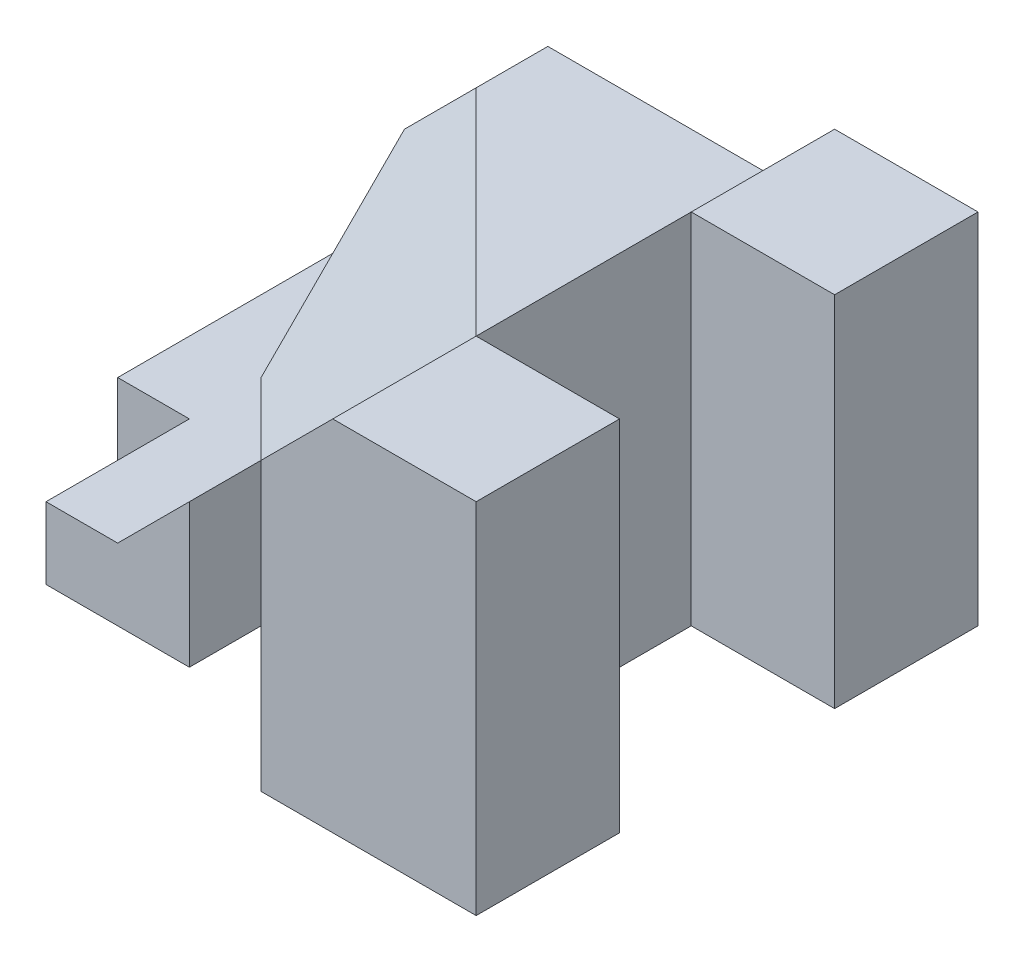
ISO-10303-21;
HEADER;
FILE_DESCRIPTION(('STEP AP214'),'2;1');
FILE_NAME('part.step','',(''),(''),'','','');
FILE_SCHEMA(('AUTOMOTIVE_DESIGN { 1 0 10303 214 1 1 1 1 }'));
ENDSEC;
DATA;
#1=APPLICATION_CONTEXT('core data for automotive mechanical design processes');
#2=APPLICATION_PROTOCOL_DEFINITION('international standard','automotive_design',2000,#1);
#3=PRODUCT_CONTEXT('',#1,'mechanical');
#4=PRODUCT('Part','Part','',(#3));
#5=PRODUCT_RELATED_PRODUCT_CATEGORY('part','',(#4));
#6=PRODUCT_DEFINITION_FORMATION('','',#4);
#7=PRODUCT_DEFINITION_CONTEXT('part definition',#1,'design');
#8=PRODUCT_DEFINITION('design','',#6,#7);
#9=PRODUCT_DEFINITION_SHAPE('','',#8);
#10=(LENGTH_UNIT() NAMED_UNIT(*) SI_UNIT(.MILLI.,.METRE.));
#11=(NAMED_UNIT(*) PLANE_ANGLE_UNIT() SI_UNIT($,.RADIAN.));
#12=(NAMED_UNIT(*) SI_UNIT($,.STERADIAN.) SOLID_ANGLE_UNIT());
#13=UNCERTAINTY_MEASURE_WITH_UNIT(LENGTH_MEASURE(1.E-05),#10,'distance_accuracy_value','');
#14=(GEOMETRIC_REPRESENTATION_CONTEXT(3) GLOBAL_UNCERTAINTY_ASSIGNED_CONTEXT((#13)) GLOBAL_UNIT_ASSIGNED_CONTEXT((#10,
#11,#12)) REPRESENTATION_CONTEXT('',''));
#15=CARTESIAN_POINT('',(0.,0.,0.));
#16=DIRECTION('',(0.,0.,1.));
#17=DIRECTION('',(1.,0.,0.));
#18=AXIS2_PLACEMENT_3D('',#15,#16,#17);
#19=CARTESIAN_POINT('',(-3.,4.,-1.));
#20=DIRECTION('',(0.,-1.,0.));
#21=DIRECTION('',(0.,0.,-1.));
#22=AXIS2_PLACEMENT_3D('',#19,#20,#21);
#23=PLANE('',#22);
#24=DIRECTION('',(-0.707106781186548,0.,-0.707106781186547));
#25=VECTOR('',#24,1.);
#26=CARTESIAN_POINT('',(-6.,4.,1.));
#27=LINE('',#26,#25);
#28=CARTESIAN_POINT('',(-3.,4.,4.));
#29=VERTEX_POINT('',#28);
#30=CARTESIAN_POINT('',(-6.,4.,1.));
#31=VERTEX_POINT('',#30);
#32=EDGE_CURVE('E44',#29,#31,#27,.T.);
#33=ORIENTED_EDGE('',*,*,#32,.F.);
#34=DIRECTION('',(0.,0.,1.));
#35=VECTOR('',#34,1.);
#36=CARTESIAN_POINT('',(-3.,4.,-1.));
#37=LINE('',#36,#35);
#38=CARTESIAN_POINT('',(-3.,4.,0.));
#39=VERTEX_POINT('',#38);
#40=EDGE_CURVE('E211',#39,#29,#37,.T.);
#41=ORIENTED_EDGE('',*,*,#40,.F.);
#42=DIRECTION('',(1.,0.,0.));
#43=VECTOR('',#42,1.);
#44=CARTESIAN_POINT('',(-8.,4.,0.));
#45=LINE('',#44,#43);
#46=CARTESIAN_POINT('',(-6.,4.,0.));
#47=VERTEX_POINT('',#46);
#48=EDGE_CURVE('E205',#47,#39,#45,.T.);
#49=ORIENTED_EDGE('',*,*,#48,.F.);
#50=DIRECTION('',(0.,0.,-1.));
#51=VECTOR('',#50,1.);
#52=CARTESIAN_POINT('',(-6.,4.,1.));
#53=LINE('',#52,#51);
#54=EDGE_CURVE('E328',#31,#47,#53,.T.);
#55=ORIENTED_EDGE('',*,*,#54,.F.);
#56=EDGE_LOOP('',(#33,#41,#49,#55));
#57=FACE_BOUND('',#56,.T.);
#58=ADVANCED_FACE('F34',(#57),#23,.F.);
#59=CARTESIAN_POINT('',(-7.,1.,0.));
#60=DIRECTION('',(0.,-1.,0.));
#61=DIRECTION('',(0.,0.,-1.));
#62=AXIS2_PLACEMENT_3D('',#59,#60,#61);
#63=PLANE('',#62);
#64=DIRECTION('',(-1.,0.,0.));
#65=VECTOR('',#64,1.);
#66=CARTESIAN_POINT('',(-7.,1.,0.));
#67=LINE('',#66,#65);
#68=CARTESIAN_POINT('',(-7.,1.,0.));
#69=VERTEX_POINT('',#68);
#70=CARTESIAN_POINT('',(-8.,1.,0.));
#71=VERTEX_POINT('',#70);
#72=EDGE_CURVE('E237',#69,#71,#67,.T.);
#73=ORIENTED_EDGE('',*,*,#72,.T.);
#74=DIRECTION('',(0.,0.,1.));
#75=VECTOR('',#74,1.);
#76=CARTESIAN_POINT('',(-8.,1.,0.));
#77=LINE('',#76,#75);
#78=CARTESIAN_POINT('',(-8.,1.,4.));
#79=VERTEX_POINT('',#78);
#80=EDGE_CURVE('E246',#71,#79,#77,.T.);
#81=ORIENTED_EDGE('',*,*,#80,.T.);
#82=DIRECTION('',(-1.,0.,0.));
#83=VECTOR('',#82,1.);
#84=CARTESIAN_POINT('',(-7.,1.,4.));
#85=LINE('',#84,#83);
#86=CARTESIAN_POINT('',(-7.,1.,4.));
#87=VERTEX_POINT('',#86);
#88=EDGE_CURVE('E52',#87,#79,#85,.T.);
#89=ORIENTED_EDGE('',*,*,#88,.F.);
#90=DIRECTION('',(0.,0.,1.));
#91=VECTOR('',#90,1.);
#92=CARTESIAN_POINT('',(-7.,1.,6.));
#93=LINE('',#92,#91);
#94=CARTESIAN_POINT('',(-7.,1.,6.));
#95=VERTEX_POINT('',#94);
#96=EDGE_CURVE('E254',#87,#95,#93,.T.);
#97=ORIENTED_EDGE('',*,*,#96,.T.);
#98=DIRECTION('',(1.,0.,0.));
#99=VECTOR('',#98,1.);
#100=CARTESIAN_POINT('',(-5.,1.,6.));
#101=LINE('',#100,#99);
#102=CARTESIAN_POINT('',(-6.,1.,6.));
#103=VERTEX_POINT('',#102);
#104=EDGE_CURVE('E252',#95,#103,#101,.T.);
#105=ORIENTED_EDGE('',*,*,#104,.T.);
#106=DIRECTION('',(0.,0.,-1.));
#107=VECTOR('',#106,1.);
#108=CARTESIAN_POINT('',(-6.,1.,11.));
#109=LINE('',#108,#107);
#110=CARTESIAN_POINT('',(-6.,1.,4.));
#111=VERTEX_POINT('',#110);
#112=EDGE_CURVE('E225',#103,#111,#109,.T.);
#113=ORIENTED_EDGE('',*,*,#112,.T.);
#114=DIRECTION('',(0.707106781186548,0.,0.707106781186547));
#115=VECTOR('',#114,1.);
#116=CARTESIAN_POINT('',(-7.,1.,3.));
#117=LINE('',#116,#115);
#118=CARTESIAN_POINT('',(-7.,1.,3.));
#119=VERTEX_POINT('',#118);
#120=EDGE_CURVE('E336',#119,#111,#117,.T.);
#121=ORIENTED_EDGE('',*,*,#120,.F.);
#122=DIRECTION('',(0.,0.,1.));
#123=VECTOR('',#122,1.);
#124=CARTESIAN_POINT('',(-7.,1.,0.));
#125=LINE('',#124,#123);
#126=EDGE_CURVE('E240',#69,#119,#125,.T.);
#127=ORIENTED_EDGE('',*,*,#126,.F.);
#128=EDGE_LOOP('',(#73,#81,#89,#97,#105,#113,#121,#127));
#129=FACE_BOUND('',#128,.T.);
#130=ADVANCED_FACE('F359',(#129),#63,.F.);
#131=CARTESIAN_POINT('',(-7.,5.,4.));
#132=DIRECTION('',(0.,0.,-1.));
#133=DIRECTION('',(-1.,0.,0.));
#134=AXIS2_PLACEMENT_3D('',#131,#132,#133);
#135=PLANE('',#134);
#136=DIRECTION('',(0.,-1.,0.));
#137=VECTOR('',#136,1.);
#138=CARTESIAN_POINT('',(-7.,5.,4.));
#139=LINE('',#138,#137);
#140=CARTESIAN_POINT('',(-7.,0.,4.));
#141=VERTEX_POINT('',#140);
#142=EDGE_CURVE('E304',#87,#141,#139,.T.);
#143=ORIENTED_EDGE('',*,*,#142,.F.);
#144=ORIENTED_EDGE('',*,*,#88,.T.);
#145=DIRECTION('',(0.,-1.,0.));
#146=VECTOR('',#145,1.);
#147=CARTESIAN_POINT('',(-8.,5.,4.));
#148=LINE('',#147,#146);
#149=CARTESIAN_POINT('',(-8.,0.,4.));
#150=VERTEX_POINT('',#149);
#151=EDGE_CURVE('E256',#79,#150,#148,.T.);
#152=ORIENTED_EDGE('',*,*,#151,.T.);
#153=DIRECTION('',(1.,0.,0.));
#154=VECTOR('',#153,1.);
#155=CARTESIAN_POINT('',(-7.,0.,4.));
#156=LINE('',#155,#154);
#157=EDGE_CURVE('E258',#150,#141,#156,.T.);
#158=ORIENTED_EDGE('',*,*,#157,.T.);
#159=EDGE_LOOP('',(#143,#144,#152,#158));
#160=FACE_BOUND('',#159,.T.);
#161=ADVANCED_FACE('F36',(#160),#135,.F.);
#162=CARTESIAN_POINT('',(-7.,5.,6.));
#163=DIRECTION('',(1.,0.,0.));
#164=DIRECTION('',(0.,0.,-1.));
#165=AXIS2_PLACEMENT_3D('',#162,#163,#164);
#166=PLANE('',#165);
#167=ORIENTED_EDGE('',*,*,#96,.F.);
#168=ORIENTED_EDGE('',*,*,#142,.T.);
#169=DIRECTION('',(0.,0.,1.));
#170=VECTOR('',#169,1.);
#171=CARTESIAN_POINT('',(-7.,0.,6.));
#172=LINE('',#171,#170);
#173=CARTESIAN_POINT('',(-7.,0.,6.));
#174=VERTEX_POINT('',#173);
#175=EDGE_CURVE('E262',#141,#174,#172,.T.);
#176=ORIENTED_EDGE('',*,*,#175,.T.);
#177=DIRECTION('',(0.,-1.,0.));
#178=VECTOR('',#177,1.);
#179=CARTESIAN_POINT('',(-7.,5.,6.));
#180=LINE('',#179,#178);
#181=EDGE_CURVE('E259',#95,#174,#180,.T.);
#182=ORIENTED_EDGE('',*,*,#181,.F.);
#183=EDGE_LOOP('',(#167,#168,#176,#182));
#184=FACE_BOUND('',#183,.T.);
#185=ADVANCED_FACE('F384',(#184),#166,.F.);
#186=CARTESIAN_POINT('',(-5.,5.,6.));
#187=DIRECTION('',(0.,0.,-1.));
#188=DIRECTION('',(-1.,0.,0.));
#189=AXIS2_PLACEMENT_3D('',#186,#187,#188);
#190=PLANE('',#189);
#191=ORIENTED_EDGE('',*,*,#104,.F.);
#192=ORIENTED_EDGE('',*,*,#181,.T.);
#193=DIRECTION('',(1.,0.,0.));
#194=VECTOR('',#193,1.);
#195=CARTESIAN_POINT('',(-5.,0.,6.));
#196=LINE('',#195,#194);
#197=CARTESIAN_POINT('',(-5.,0.,6.));
#198=VERTEX_POINT('',#197);
#199=EDGE_CURVE('E261',#174,#198,#196,.T.);
#200=ORIENTED_EDGE('',*,*,#199,.T.);
#201=DIRECTION('',(0.,-1.,0.));
#202=VECTOR('',#201,1.);
#203=CARTESIAN_POINT('',(-5.,5.,6.));
#204=LINE('',#203,#202);
#205=CARTESIAN_POINT('',(-5.,2.,6.));
#206=VERTEX_POINT('',#205);
#207=EDGE_CURVE('E263',#206,#198,#204,.T.);
#208=ORIENTED_EDGE('',*,*,#207,.F.);
#209=DIRECTION('',(0.707106781186548,0.707106781186548,0.));
#210=VECTOR('',#209,1.);
#211=CARTESIAN_POINT('',(-3.5,3.5,6.));
#212=LINE('',#211,#210);
#213=EDGE_CURVE('E222',#103,#206,#212,.T.);
#214=ORIENTED_EDGE('',*,*,#213,.F.);
#215=EDGE_LOOP('',(#191,#192,#200,#208,#214));
#216=FACE_BOUND('',#215,.T.);
#217=ADVANCED_FACE('F386',(#216),#190,.F.);
#218=CARTESIAN_POINT('',(-5.,5.,5.));
#219=DIRECTION('',(-1.,0.,0.));
#220=DIRECTION('',(0.,0.,1.));
#221=AXIS2_PLACEMENT_3D('',#218,#219,#220);
#222=PLANE('',#221);
#223=DIRECTION('',(0.,0.,-1.));
#224=VECTOR('',#223,1.);
#225=CARTESIAN_POINT('',(-5.,2.,5.));
#226=LINE('',#225,#224);
#227=CARTESIAN_POINT('',(-5.,2.,5.));
#228=VERTEX_POINT('',#227);
#229=EDGE_CURVE('E224',#206,#228,#226,.T.);
#230=ORIENTED_EDGE('',*,*,#229,.F.);
#231=ORIENTED_EDGE('',*,*,#207,.T.);
#232=DIRECTION('',(0.,0.,-1.));
#233=VECTOR('',#232,1.);
#234=CARTESIAN_POINT('',(-5.,0.,5.));
#235=LINE('',#234,#233);
#236=CARTESIAN_POINT('',(-5.,0.,5.));
#237=VERTEX_POINT('',#236);
#238=EDGE_CURVE('E265',#198,#237,#235,.T.);
#239=ORIENTED_EDGE('',*,*,#238,.T.);
#240=DIRECTION('',(0.,-1.,0.));
#241=VECTOR('',#240,1.);
#242=CARTESIAN_POINT('',(-5.,5.,5.));
#243=LINE('',#242,#241);
#244=EDGE_CURVE('E266',#228,#237,#243,.T.);
#245=ORIENTED_EDGE('',*,*,#244,.F.);
#246=EDGE_LOOP('',(#230,#231,#239,#245));
#247=FACE_BOUND('',#246,.T.);
#248=ADVANCED_FACE('F392',(#247),#222,.F.);
#249=CARTESIAN_POINT('',(-3.,5.,5.));
#250=DIRECTION('',(0.,0.,-1.));
#251=DIRECTION('',(-1.,0.,0.));
#252=AXIS2_PLACEMENT_3D('',#249,#250,#251);
#253=PLANE('',#252);
#254=DIRECTION('',(0.707106781186548,0.707106781186548,0.));
#255=VECTOR('',#254,1.);
#256=CARTESIAN_POINT('',(-2.5,4.5,5.));
#257=LINE('',#256,#255);
#258=CARTESIAN_POINT('',(-3.,4.,5.));
#259=VERTEX_POINT('',#258);
#260=EDGE_CURVE('E227',#228,#259,#257,.T.);
#261=ORIENTED_EDGE('',*,*,#260,.F.);
#262=ORIENTED_EDGE('',*,*,#244,.T.);
#263=DIRECTION('',(1.,0.,0.));
#264=VECTOR('',#263,1.);
#265=CARTESIAN_POINT('',(-3.,0.,5.));
#266=LINE('',#265,#264);
#267=CARTESIAN_POINT('',(-3.,0.,5.));
#268=VERTEX_POINT('',#267);
#269=EDGE_CURVE('E268',#237,#268,#266,.T.);
#270=ORIENTED_EDGE('',*,*,#269,.T.);
#271=DIRECTION('',(0.,-1.,0.));
#272=VECTOR('',#271,1.);
#273=CARTESIAN_POINT('',(-3.,5.,5.));
#274=LINE('',#273,#272);
#275=EDGE_CURVE('E269',#259,#268,#274,.T.);
#276=ORIENTED_EDGE('',*,*,#275,.F.);
#277=EDGE_LOOP('',(#261,#262,#270,#276));
#278=FACE_BOUND('',#277,.T.);
#279=ADVANCED_FACE('F395',(#278),#253,.F.);
#280=CARTESIAN_POINT('',(-3.,5.,7.));
#281=DIRECTION('',(1.,0.,0.));
#282=DIRECTION('',(0.,0.,-1.));
#283=AXIS2_PLACEMENT_3D('',#280,#281,#282);
#284=PLANE('',#283);
#285=DIRECTION('',(0.,0.,1.));
#286=VECTOR('',#285,1.);
#287=CARTESIAN_POINT('',(-3.,4.,7.));
#288=LINE('',#287,#286);
#289=CARTESIAN_POINT('',(-3.,4.,7.));
#290=VERTEX_POINT('',#289);
#291=EDGE_CURVE('E229',#259,#290,#288,.T.);
#292=ORIENTED_EDGE('',*,*,#291,.F.);
#293=ORIENTED_EDGE('',*,*,#275,.T.);
#294=DIRECTION('',(0.,0.,1.));
#295=VECTOR('',#294,1.);
#296=CARTESIAN_POINT('',(-3.,0.,7.));
#297=LINE('',#296,#295);
#298=CARTESIAN_POINT('',(-3.,0.,7.));
#299=VERTEX_POINT('',#298);
#300=EDGE_CURVE('E271',#268,#299,#297,.T.);
#301=ORIENTED_EDGE('',*,*,#300,.T.);
#302=DIRECTION('',(0.,-1.,0.));
#303=VECTOR('',#302,1.);
#304=CARTESIAN_POINT('',(-3.,5.,7.));
#305=LINE('',#304,#303);
#306=EDGE_CURVE('E272',#290,#299,#305,.T.);
#307=ORIENTED_EDGE('',*,*,#306,.F.);
#308=EDGE_LOOP('',(#292,#293,#301,#307));
#309=FACE_BOUND('',#308,.T.);
#310=ADVANCED_FACE('F402',(#309),#284,.F.);
#311=CARTESIAN_POINT('',(0.,5.,7.));
#312=DIRECTION('',(0.,0.,-1.));
#313=DIRECTION('',(-1.,0.,0.));
#314=AXIS2_PLACEMENT_3D('',#311,#312,#313);
#315=PLANE('',#314);
#316=DIRECTION('',(0.707106781186548,0.707106781186548,0.));
#317=VECTOR('',#316,1.);
#318=CARTESIAN_POINT('',(-0.999999999999999,6.,7.));
#319=LINE('',#318,#317);
#320=CARTESIAN_POINT('',(-2.,5.,7.));
#321=VERTEX_POINT('',#320);
#322=EDGE_CURVE('E231',#290,#321,#319,.T.);
#323=ORIENTED_EDGE('',*,*,#322,.F.);
#324=ORIENTED_EDGE('',*,*,#306,.T.);
#325=DIRECTION('',(1.,0.,0.));
#326=VECTOR('',#325,1.);
#327=CARTESIAN_POINT('',(0.,0.,7.));
#328=LINE('',#327,#326);
#329=CARTESIAN_POINT('',(0.,0.,7.));
#330=VERTEX_POINT('',#329);
#331=EDGE_CURVE('E220',#299,#330,#328,.T.);
#332=ORIENTED_EDGE('',*,*,#331,.T.);
#333=DIRECTION('',(0.,-1.,0.));
#334=VECTOR('',#333,1.);
#335=CARTESIAN_POINT('',(0.,5.,7.));
#336=LINE('',#335,#334);
#337=CARTESIAN_POINT('',(0.,5.,7.));
#338=VERTEX_POINT('',#337);
#339=EDGE_CURVE('E274',#338,#330,#336,.T.);
#340=ORIENTED_EDGE('',*,*,#339,.F.);
#341=DIRECTION('',(1.,0.,0.));
#342=VECTOR('',#341,1.);
#343=CARTESIAN_POINT('',(0.,5.,7.));
#344=LINE('',#343,#342);
#345=EDGE_CURVE('E218',#321,#338,#344,.T.);
#346=ORIENTED_EDGE('',*,*,#345,.F.);
#347=EDGE_LOOP('',(#323,#324,#332,#340,#346));
#348=FACE_BOUND('',#347,.T.);
#349=ADVANCED_FACE('F405',(#348),#315,.F.);
#350=CARTESIAN_POINT('',(0.,5.,0.));
#351=DIRECTION('',(0.,-1.,0.));
#352=DIRECTION('',(0.,0.,-1.));
#353=AXIS2_PLACEMENT_3D('',#350,#351,#352);
#354=PLANE('',#353);
#355=DIRECTION('',(0.,0.,-1.));
#356=VECTOR('',#355,1.);
#357=CARTESIAN_POINT('',(-2.,5.,0.));
#358=LINE('',#357,#356);
#359=CARTESIAN_POINT('',(-2.,5.,5.));
#360=VERTEX_POINT('',#359);
#361=EDGE_CURVE('E212',#321,#360,#358,.T.);
#362=ORIENTED_EDGE('',*,*,#361,.F.);
#363=ORIENTED_EDGE('',*,*,#345,.T.);
#364=DIRECTION('',(0.,0.,-1.));
#365=VECTOR('',#364,1.);
#366=CARTESIAN_POINT('',(0.,5.,5.));
#367=LINE('',#366,#365);
#368=CARTESIAN_POINT('',(0.,5.,5.));
#369=VERTEX_POINT('',#368);
#370=EDGE_CURVE('E216',#338,#369,#367,.T.);
#371=ORIENTED_EDGE('',*,*,#370,.T.);
#372=DIRECTION('',(-1.,0.,0.));
#373=VECTOR('',#372,1.);
#374=CARTESIAN_POINT('',(-2.,5.,5.));
#375=LINE('',#374,#373);
#376=EDGE_CURVE('E213',#369,#360,#375,.T.);
#377=ORIENTED_EDGE('',*,*,#376,.T.);
#378=EDGE_LOOP('',(#362,#363,#371,#377));
#379=FACE_BOUND('',#378,.T.);
#380=ADVANCED_FACE('F410',(#379),#354,.F.);
#381=DIRECTION('',(-1.,0.,0.));
#382=VECTOR('',#381,1.);
#383=CARTESIAN_POINT('',(-8.,5.,0.));
#384=LINE('',#383,#382);
#385=CARTESIAN_POINT('',(0.,5.,0.));
#386=VERTEX_POINT('',#385);
#387=CARTESIAN_POINT('',(-2.,5.,0.));
#388=VERTEX_POINT('',#387);
#389=EDGE_CURVE('E189',#386,#388,#384,.T.);
#390=ORIENTED_EDGE('',*,*,#389,.T.);
#391=DIRECTION('',(0.,0.,1.));
#392=VECTOR('',#391,1.);
#393=CARTESIAN_POINT('',(-2.,5.,-1.));
#394=LINE('',#393,#392);
#395=CARTESIAN_POINT('',(-2.,5.,2.));
#396=VERTEX_POINT('',#395);
#397=EDGE_CURVE('E208',#388,#396,#394,.T.);
#398=ORIENTED_EDGE('',*,*,#397,.T.);
#399=DIRECTION('',(1.,0.,0.));
#400=VECTOR('',#399,1.);
#401=CARTESIAN_POINT('',(0.,5.,2.));
#402=LINE('',#401,#400);
#403=CARTESIAN_POINT('',(0.,5.,2.));
#404=VERTEX_POINT('',#403);
#405=EDGE_CURVE('E206',#396,#404,#402,.T.);
#406=ORIENTED_EDGE('',*,*,#405,.T.);
#407=DIRECTION('',(0.,0.,-1.));
#408=VECTOR('',#407,1.);
#409=CARTESIAN_POINT('',(0.,5.,0.));
#410=LINE('',#409,#408);
#411=EDGE_CURVE('E203',#404,#386,#410,.T.);
#412=ORIENTED_EDGE('',*,*,#411,.T.);
#413=EDGE_LOOP('',(#390,#398,#406,#412));
#414=FACE_BOUND('',#413,.T.);
#415=ADVANCED_FACE('F425',(#414),#354,.F.);
#416=CARTESIAN_POINT('',(-8.,5.,0.));
#417=DIRECTION('',(0.,0.,1.));
#418=DIRECTION('',(1.,0.,0.));
#419=AXIS2_PLACEMENT_3D('',#416,#417,#418);
#420=PLANE('',#419);
#421=DIRECTION('',(0.,-1.,0.));
#422=VECTOR('',#421,1.);
#423=CARTESIAN_POINT('',(-7.,1.,0.));
#424=LINE('',#423,#422);
#425=CARTESIAN_POINT('',(-7.,3.,0.));
#426=VERTEX_POINT('',#425);
#427=EDGE_CURVE('E325',#426,#69,#424,.T.);
#428=ORIENTED_EDGE('',*,*,#427,.F.);
#429=DIRECTION('',(-0.707106781186548,-0.707106781186548,0.));
#430=VECTOR('',#429,1.);
#431=CARTESIAN_POINT('',(-6.,4.,0.));
#432=LINE('',#431,#430);
#433=EDGE_CURVE('E329',#47,#426,#432,.T.);
#434=ORIENTED_EDGE('',*,*,#433,.F.);
#435=ORIENTED_EDGE('',*,*,#48,.T.);
#436=DIRECTION('',(0.707106781186547,0.707106781186548,0.));
#437=VECTOR('',#436,1.);
#438=CARTESIAN_POINT('',(-5.,2.,0.));
#439=LINE('',#438,#437);
#440=EDGE_CURVE('E190',#39,#388,#439,.T.);
#441=ORIENTED_EDGE('',*,*,#440,.T.);
#442=ORIENTED_EDGE('',*,*,#389,.F.);
#443=DIRECTION('',(0.,-1.,0.));
#444=VECTOR('',#443,1.);
#445=CARTESIAN_POINT('',(0.,5.,0.));
#446=LINE('',#445,#444);
#447=CARTESIAN_POINT('',(0.,0.,0.));
#448=VERTEX_POINT('',#447);
#449=EDGE_CURVE('E172',#386,#448,#446,.T.);
#450=ORIENTED_EDGE('',*,*,#449,.T.);
#451=DIRECTION('',(-1.,0.,0.));
#452=VECTOR('',#451,1.);
#453=CARTESIAN_POINT('',(-8.,0.,0.));
#454=LINE('',#453,#452);
#455=CARTESIAN_POINT('',(-8.,0.,0.));
#456=VERTEX_POINT('',#455);
#457=EDGE_CURVE('E186',#448,#456,#454,.T.);
#458=ORIENTED_EDGE('',*,*,#457,.T.);
#459=DIRECTION('',(0.,-1.,0.));
#460=VECTOR('',#459,1.);
#461=CARTESIAN_POINT('',(-8.,5.,0.));
#462=LINE('',#461,#460);
#463=EDGE_CURVE('E197',#71,#456,#462,.T.);
#464=ORIENTED_EDGE('',*,*,#463,.F.);
#465=ORIENTED_EDGE('',*,*,#72,.F.);
#466=EDGE_LOOP('',(#428,#434,#435,#441,#442,#450,#458,#464,#465));
#467=FACE_BOUND('',#466,.T.);
#468=ADVANCED_FACE('F184',(#467),#420,.F.);
#469=CARTESIAN_POINT('',(-8.,5.,4.));
#470=DIRECTION('',(1.,0.,0.));
#471=DIRECTION('',(0.,0.,-1.));
#472=AXIS2_PLACEMENT_3D('',#469,#470,#471);
#473=PLANE('',#472);
#474=ORIENTED_EDGE('',*,*,#151,.F.);
#475=ORIENTED_EDGE('',*,*,#80,.F.);
#476=ORIENTED_EDGE('',*,*,#463,.T.);
#477=DIRECTION('',(0.,0.,1.));
#478=VECTOR('',#477,1.);
#479=CARTESIAN_POINT('',(-8.,0.,4.));
#480=LINE('',#479,#478);
#481=EDGE_CURVE('E196',#456,#150,#480,.T.);
#482=ORIENTED_EDGE('',*,*,#481,.T.);
#483=EDGE_LOOP('',(#474,#475,#476,#482));
#484=FACE_BOUND('',#483,.T.);
#485=ADVANCED_FACE('F380',(#484),#473,.F.);
#486=CARTESIAN_POINT('',(0.,5.,5.));
#487=DIRECTION('',(-1.,0.,0.));
#488=DIRECTION('',(0.,0.,1.));
#489=AXIS2_PLACEMENT_3D('',#486,#487,#488);
#490=PLANE('',#489);
#491=DIRECTION('',(0.,0.,-1.));
#492=VECTOR('',#491,1.);
#493=CARTESIAN_POINT('',(0.,0.,5.));
#494=LINE('',#493,#492);
#495=CARTESIAN_POINT('',(0.,0.,5.));
#496=VERTEX_POINT('',#495);
#497=EDGE_CURVE('E278',#330,#496,#494,.T.);
#498=ORIENTED_EDGE('',*,*,#497,.T.);
#499=DIRECTION('',(0.,-1.,0.));
#500=VECTOR('',#499,1.);
#501=CARTESIAN_POINT('',(0.,5.,5.));
#502=LINE('',#501,#500);
#503=EDGE_CURVE('E279',#369,#496,#502,.T.);
#504=ORIENTED_EDGE('',*,*,#503,.F.);
#505=ORIENTED_EDGE('',*,*,#370,.F.);
#506=ORIENTED_EDGE('',*,*,#339,.T.);
#507=EDGE_LOOP('',(#498,#504,#505,#506));
#508=FACE_BOUND('',#507,.T.);
#509=ADVANCED_FACE('F430',(#508),#490,.F.);
#510=CARTESIAN_POINT('',(-2.,5.,5.));
#511=DIRECTION('',(0.,0.,1.));
#512=DIRECTION('',(1.,0.,0.));
#513=AXIS2_PLACEMENT_3D('',#510,#511,#512);
#514=PLANE('',#513);
#515=DIRECTION('',(-1.,0.,0.));
#516=VECTOR('',#515,1.);
#517=CARTESIAN_POINT('',(-2.,0.,5.));
#518=LINE('',#517,#516);
#519=CARTESIAN_POINT('',(-2.,0.,5.));
#520=VERTEX_POINT('',#519);
#521=EDGE_CURVE('E277',#496,#520,#518,.T.);
#522=ORIENTED_EDGE('',*,*,#521,.T.);
#523=DIRECTION('',(0.,-1.,0.));
#524=VECTOR('',#523,1.);
#525=CARTESIAN_POINT('',(-2.,5.,5.));
#526=LINE('',#525,#524);
#527=EDGE_CURVE('E283',#360,#520,#526,.T.);
#528=ORIENTED_EDGE('',*,*,#527,.F.);
#529=ORIENTED_EDGE('',*,*,#376,.F.);
#530=ORIENTED_EDGE('',*,*,#503,.T.);
#531=EDGE_LOOP('',(#522,#528,#529,#530));
#532=FACE_BOUND('',#531,.T.);
#533=ADVANCED_FACE('F417',(#532),#514,.F.);
#534=CARTESIAN_POINT('',(-2.,5.,2.));
#535=DIRECTION('',(-1.,0.,0.));
#536=DIRECTION('',(0.,0.,1.));
#537=AXIS2_PLACEMENT_3D('',#534,#535,#536);
#538=PLANE('',#537);
#539=DIRECTION('',(0.,0.,-1.));
#540=VECTOR('',#539,1.);
#541=CARTESIAN_POINT('',(-2.,0.,2.));
#542=LINE('',#541,#540);
#543=CARTESIAN_POINT('',(-2.,0.,2.));
#544=VERTEX_POINT('',#543);
#545=EDGE_CURVE('E282',#520,#544,#542,.T.);
#546=ORIENTED_EDGE('',*,*,#545,.T.);
#547=DIRECTION('',(0.,-1.,0.));
#548=VECTOR('',#547,1.);
#549=CARTESIAN_POINT('',(-2.,5.,2.));
#550=LINE('',#549,#548);
#551=EDGE_CURVE('E179',#396,#544,#550,.T.);
#552=ORIENTED_EDGE('',*,*,#551,.F.);
#553=DIRECTION('',(0.,0.,-1.));
#554=VECTOR('',#553,1.);
#555=CARTESIAN_POINT('',(-2.,5.,2.));
#556=LINE('',#555,#554);
#557=EDGE_CURVE('E209',#360,#396,#556,.T.);
#558=ORIENTED_EDGE('',*,*,#557,.F.);
#559=ORIENTED_EDGE('',*,*,#527,.T.);
#560=EDGE_LOOP('',(#546,#552,#558,#559));
#561=FACE_BOUND('',#560,.T.);
#562=ADVANCED_FACE('F422',(#561),#538,.F.);
#563=CARTESIAN_POINT('',(0.,5.,2.));
#564=DIRECTION('',(0.,0.,-1.));
#565=DIRECTION('',(-1.,0.,0.));
#566=AXIS2_PLACEMENT_3D('',#563,#564,#565);
#567=PLANE('',#566);
#568=DIRECTION('',(1.,0.,0.));
#569=VECTOR('',#568,1.);
#570=CARTESIAN_POINT('',(0.,0.,2.));
#571=LINE('',#570,#569);
#572=CARTESIAN_POINT('',(0.,0.,2.));
#573=VERTEX_POINT('',#572);
#574=EDGE_CURVE('E286',#544,#573,#571,.T.);
#575=ORIENTED_EDGE('',*,*,#574,.T.);
#576=DIRECTION('',(0.,-1.,0.));
#577=VECTOR('',#576,1.);
#578=CARTESIAN_POINT('',(0.,5.,2.));
#579=LINE('',#578,#577);
#580=EDGE_CURVE('E175',#404,#573,#579,.T.);
#581=ORIENTED_EDGE('',*,*,#580,.F.);
#582=ORIENTED_EDGE('',*,*,#405,.F.);
#583=ORIENTED_EDGE('',*,*,#551,.T.);
#584=EDGE_LOOP('',(#575,#581,#582,#583));
#585=FACE_BOUND('',#584,.T.);
#586=ADVANCED_FACE('F427',(#585),#567,.F.);
#587=CARTESIAN_POINT('',(0.,5.,0.));
#588=DIRECTION('',(-1.,0.,0.));
#589=DIRECTION('',(0.,0.,1.));
#590=AXIS2_PLACEMENT_3D('',#587,#588,#589);
#591=PLANE('',#590);
#592=DIRECTION('',(0.,0.,-1.));
#593=VECTOR('',#592,1.);
#594=CARTESIAN_POINT('',(0.,0.,0.));
#595=LINE('',#594,#593);
#596=EDGE_CURVE('E168',#573,#448,#595,.T.);
#597=ORIENTED_EDGE('',*,*,#596,.T.);
#598=ORIENTED_EDGE('',*,*,#449,.F.);
#599=ORIENTED_EDGE('',*,*,#411,.F.);
#600=ORIENTED_EDGE('',*,*,#580,.T.);
#601=EDGE_LOOP('',(#597,#598,#599,#600));
#602=FACE_BOUND('',#601,.T.);
#603=ADVANCED_FACE('F170',(#602),#591,.F.);
#604=CARTESIAN_POINT('',(0.,0.,0.));
#605=DIRECTION('',(0.,-1.,0.));
#606=DIRECTION('',(0.,0.,-1.));
#607=AXIS2_PLACEMENT_3D('',#604,#605,#606);
#608=PLANE('',#607);
#609=ORIENTED_EDGE('',*,*,#457,.F.);
#610=ORIENTED_EDGE('',*,*,#596,.F.);
#611=ORIENTED_EDGE('',*,*,#574,.F.);
#612=ORIENTED_EDGE('',*,*,#545,.F.);
#613=ORIENTED_EDGE('',*,*,#521,.F.);
#614=ORIENTED_EDGE('',*,*,#497,.F.);
#615=ORIENTED_EDGE('',*,*,#331,.F.);
#616=ORIENTED_EDGE('',*,*,#300,.F.);
#617=ORIENTED_EDGE('',*,*,#269,.F.);
#618=ORIENTED_EDGE('',*,*,#238,.F.);
#619=ORIENTED_EDGE('',*,*,#199,.F.);
#620=ORIENTED_EDGE('',*,*,#175,.F.);
#621=ORIENTED_EDGE('',*,*,#157,.F.);
#622=ORIENTED_EDGE('',*,*,#481,.F.);
#623=EDGE_LOOP('',(#609,#610,#611,#612,#613,#614,#615,#616,#617,#618,#619,#620,#621,#622));
#624=FACE_BOUND('',#623,.T.);
#625=ADVANCED_FACE('F193',(#624),#608,.T.);
#626=CARTESIAN_POINT('',(-6.,1.,11.));
#627=DIRECTION('',(-0.707106781186548,0.707106781186548,0.));
#628=DIRECTION('',(-0.707106781186548,-0.707106781186548,0.));
#629=AXIS2_PLACEMENT_3D('',#626,#627,#628);
#630=PLANE('',#629);
#631=ORIENTED_EDGE('',*,*,#213,.T.);
#632=ORIENTED_EDGE('',*,*,#229,.T.);
#633=ORIENTED_EDGE('',*,*,#260,.T.);
#634=ORIENTED_EDGE('',*,*,#291,.T.);
#635=ORIENTED_EDGE('',*,*,#322,.T.);
#636=ORIENTED_EDGE('',*,*,#361,.T.);
#637=ORIENTED_EDGE('',*,*,#557,.T.);
#638=ORIENTED_EDGE('',*,*,#397,.F.);
#639=ORIENTED_EDGE('',*,*,#440,.F.);
#640=ORIENTED_EDGE('',*,*,#40,.T.);
#641=DIRECTION('',(0.707106781186548,0.707106781186548,0.));
#642=VECTOR('',#641,1.);
#643=CARTESIAN_POINT('',(-6.,1.,4.));
#644=LINE('',#643,#642);
#645=EDGE_CURVE('E343',#111,#29,#644,.T.);
#646=ORIENTED_EDGE('',*,*,#645,.F.);
#647=ORIENTED_EDGE('',*,*,#112,.F.);
#648=EDGE_LOOP('',(#631,#632,#633,#634,#635,#636,#637,#638,#639,#640,#646,#647));
#649=FACE_BOUND('',#648,.T.);
#650=ADVANCED_FACE('F365',(#649),#630,.T.);
#651=CARTESIAN_POINT('',(-7.,0.,0.));
#652=DIRECTION('',(1.,0.,0.));
#653=DIRECTION('',(0.,0.,-1.));
#654=AXIS2_PLACEMENT_3D('',#651,#652,#653);
#655=PLANE('',#654);
#656=ORIENTED_EDGE('',*,*,#126,.T.);
#657=DIRECTION('',(0.,-0.707106781186548,0.707106781186548));
#658=VECTOR('',#657,1.);
#659=CARTESIAN_POINT('',(-7.,1.,3.));
#660=LINE('',#659,#658);
#661=CARTESIAN_POINT('',(-7.,3.,1.));
#662=VERTEX_POINT('',#661);
#663=EDGE_CURVE('E38',#662,#119,#660,.T.);
#664=ORIENTED_EDGE('',*,*,#663,.F.);
#665=DIRECTION('',(0.,0.,-1.));
#666=VECTOR('',#665,1.);
#667=CARTESIAN_POINT('',(-7.,3.,1.));
#668=LINE('',#667,#666);
#669=EDGE_CURVE('E251',#662,#426,#668,.T.);
#670=ORIENTED_EDGE('',*,*,#669,.T.);
#671=ORIENTED_EDGE('',*,*,#427,.T.);
#672=EDGE_LOOP('',(#656,#664,#670,#671));
#673=FACE_BOUND('',#672,.T.);
#674=ADVANCED_FACE('F376',(#673),#655,.F.);
#675=CARTESIAN_POINT('',(-6.,4.,1.));
#676=DIRECTION('',(0.707106781186547,-0.707106781186547,0.));
#677=DIRECTION('',(0.707106781186548,0.707106781186548,0.));
#678=AXIS2_PLACEMENT_3D('',#675,#676,#677);
#679=PLANE('',#678);
#680=ORIENTED_EDGE('',*,*,#433,.T.);
#681=ORIENTED_EDGE('',*,*,#669,.F.);
#682=DIRECTION('',(-0.707106781186548,-0.707106781186548,0.));
#683=VECTOR('',#682,1.);
#684=CARTESIAN_POINT('',(-6.,4.,1.));
#685=LINE('',#684,#683);
#686=EDGE_CURVE('E12',#31,#662,#685,.T.);
#687=ORIENTED_EDGE('',*,*,#686,.F.);
#688=ORIENTED_EDGE('',*,*,#54,.T.);
#689=EDGE_LOOP('',(#680,#681,#687,#688));
#690=FACE_BOUND('',#689,.T.);
#691=ADVANCED_FACE('F374',(#690),#679,.F.);
#692=CARTESIAN_POINT('',(-3.66666666666665,3.66666666666666,3.66666666666668));
#693=DIRECTION('',(-0.577350269189624,0.577350269189625,0.577350269189628));
#694=DIRECTION('',(0.,-0.707106781186549,0.707106781186546));
#695=AXIS2_PLACEMENT_3D('',#692,#693,#694);
#696=PLANE('',#695);
#697=ORIENTED_EDGE('',*,*,#663,.T.);
#698=ORIENTED_EDGE('',*,*,#120,.T.);
#699=ORIENTED_EDGE('',*,*,#645,.T.);
#700=ORIENTED_EDGE('',*,*,#32,.T.);
#701=ORIENTED_EDGE('',*,*,#686,.T.);
#702=EDGE_LOOP('',(#697,#698,#699,#700,#701));
#703=FACE_BOUND('',#702,.T.);
#704=ADVANCED_FACE('F372',(#703),#696,.T.);
#705=CLOSED_SHELL('',(#58,#130,#161,#185,#217,#248,#279,#310,#349,#380,#415,#468,#485,#509,#533,
#562,#586,#603,#625,#650,#674,#691,#704));
#706=MANIFOLD_SOLID_BREP('B2',#705);
#707=ADVANCED_BREP_SHAPE_REPRESENTATION('',(#18,#706),#14);
#708=SHAPE_DEFINITION_REPRESENTATION(#9,#707);
ENDSEC;
END-ISO-10303-21;
